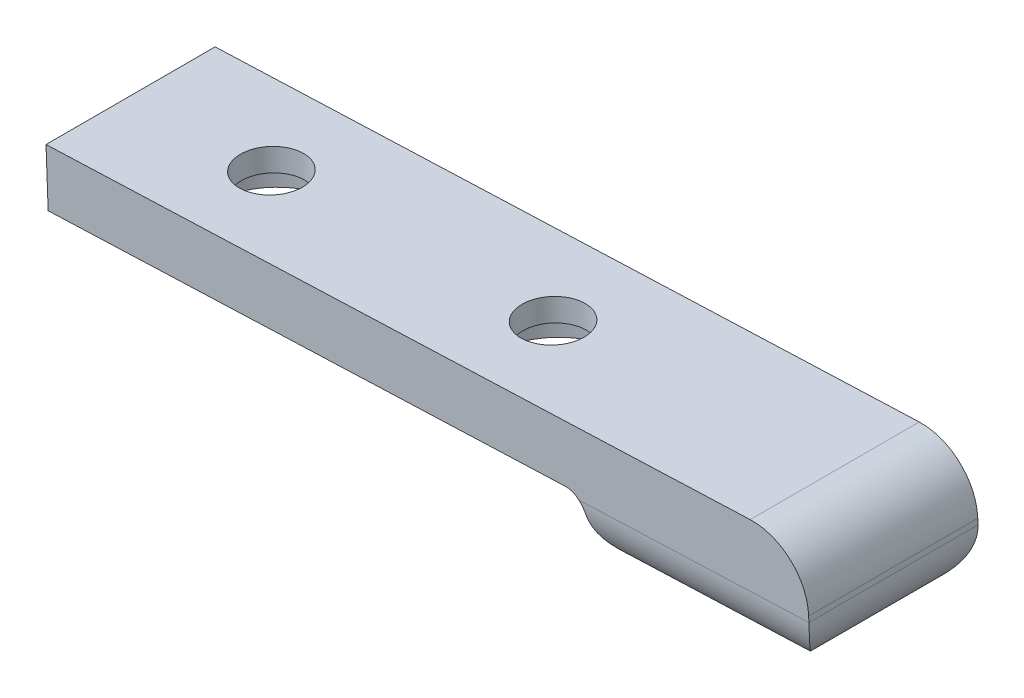
ISO-10303-21;
HEADER;
FILE_DESCRIPTION(('STEP AP214'),'2;1');
FILE_NAME('part.step','',(''),(''),'','','');
FILE_SCHEMA(('AUTOMOTIVE_DESIGN { 1 0 10303 214 1 1 1 1 }'));
ENDSEC;
DATA;
#1=APPLICATION_CONTEXT('core data for automotive mechanical design processes');
#2=APPLICATION_PROTOCOL_DEFINITION('international standard','automotive_design',2000,#1);
#3=PRODUCT_CONTEXT('',#1,'mechanical');
#4=PRODUCT('Part','Part','',(#3));
#5=PRODUCT_RELATED_PRODUCT_CATEGORY('part','',(#4));
#6=PRODUCT_DEFINITION_FORMATION('','',#4);
#7=PRODUCT_DEFINITION_CONTEXT('part definition',#1,'design');
#8=PRODUCT_DEFINITION('design','',#6,#7);
#9=PRODUCT_DEFINITION_SHAPE('','',#8);
#10=(LENGTH_UNIT() NAMED_UNIT(*) SI_UNIT(.MILLI.,.METRE.));
#11=(NAMED_UNIT(*) PLANE_ANGLE_UNIT() SI_UNIT($,.RADIAN.));
#12=(NAMED_UNIT(*) SI_UNIT($,.STERADIAN.) SOLID_ANGLE_UNIT());
#13=UNCERTAINTY_MEASURE_WITH_UNIT(LENGTH_MEASURE(1.E-05),#10,'distance_accuracy_value','');
#14=(GEOMETRIC_REPRESENTATION_CONTEXT(3) GLOBAL_UNCERTAINTY_ASSIGNED_CONTEXT((#13)) GLOBAL_UNIT_ASSIGNED_CONTEXT((#10,
#11,#12)) REPRESENTATION_CONTEXT('',''));
#15=CARTESIAN_POINT('',(0.,0.,0.));
#16=DIRECTION('',(0.,0.,1.));
#17=DIRECTION('',(1.,0.,0.));
#18=AXIS2_PLACEMENT_3D('',#15,#16,#17);
#19=CARTESIAN_POINT('',(-19.5902158138393,8.31178115992963,104.999971631863));
#20=DIRECTION('',(-0.0386212432650092,0.999253921467744,0.));
#21=DIRECTION('',(-0.999253921467744,-0.0386212432650092,0.));
#22=AXIS2_PLACEMENT_3D('',#19,#20,#21);
#23=CYLINDRICAL_SURFACE('',#22,1.10000000000001);
#24=CARTESIAN_POINT('',(-19.6674583003693,10.3102890028651,104.999971631863));
#25=DIRECTION('',(0.0386212432650092,-0.999253921467744,0.));
#26=DIRECTION('',(0.999253921467744,0.0386212432650092,0.));
#27=AXIS2_PLACEMENT_3D('',#24,#25,#26);
#28=CIRCLE('',#27,1.10000000000001);
#29=CARTESIAN_POINT('',(-18.5682789867548,10.3527723704566,104.999971631863));
#30=VERTEX_POINT('',#29);
#31=EDGE_CURVE('E269',#30,#30,#28,.T.);
#32=ORIENTED_EDGE('',*,*,#31,.F.);
#33=EDGE_LOOP('',(#32));
#34=FACE_BOUND('',#33,.T.);
#35=CARTESIAN_POINT('',(-19.6365613057573,9.51088586569093,104.999971631863));
#36=DIRECTION('',(0.0386212432650091,-0.999253921467744,0.));
#37=DIRECTION('',(0.999253921467744,0.0386212432650091,0.));
#38=AXIS2_PLACEMENT_3D('',#35,#36,#37);
#39=CIRCLE('',#38,1.10000000000001);
#40=CARTESIAN_POINT('',(-18.5373819921428,9.55336923328244,104.999971631863));
#41=VERTEX_POINT('',#40);
#42=EDGE_CURVE('E164',#41,#41,#39,.T.);
#43=ORIENTED_EDGE('',*,*,#42,.T.);
#44=EDGE_LOOP('',(#43));
#45=FACE_BOUND('',#44,.T.);
#46=ADVANCED_FACE('F33',(#34,#45),#23,.F.);
#47=CARTESIAN_POINT('',(-29.5827550285167,7.92556872727954,104.999971194749));
#48=DIRECTION('',(-0.0386212432650092,0.999253921467744,0.));
#49=DIRECTION('',(-0.999253921467744,-0.0386212432650092,0.));
#50=AXIS2_PLACEMENT_3D('',#47,#48,#49);
#51=CYLINDRICAL_SURFACE('',#50,1.10000000000001);
#52=CARTESIAN_POINT('',(-29.6599975150467,9.92407657021503,104.999971194749));
#53=DIRECTION('',(0.0386212432650092,-0.999253921467744,0.));
#54=DIRECTION('',(0.999253921467744,0.0386212432650092,0.));
#55=AXIS2_PLACEMENT_3D('',#52,#53,#54);
#56=CIRCLE('',#55,1.10000000000001);
#57=CARTESIAN_POINT('',(-28.5608182014322,9.96655993780654,104.999971194749));
#58=VERTEX_POINT('',#57);
#59=EDGE_CURVE('E173',#58,#58,#56,.T.);
#60=ORIENTED_EDGE('',*,*,#59,.F.);
#61=EDGE_LOOP('',(#60));
#62=FACE_BOUND('',#61,.T.);
#63=CARTESIAN_POINT('',(-29.6291005204347,9.12467343304083,104.999971194749));
#64=DIRECTION('',(0.0386212432650091,-0.999253921467744,0.));
#65=DIRECTION('',(0.999253921467744,0.0386212432650091,0.));
#66=AXIS2_PLACEMENT_3D('',#63,#64,#65);
#67=CIRCLE('',#66,1.10000000000001);
#68=CARTESIAN_POINT('',(-28.5299212068202,9.16715680063235,104.999971194749));
#69=VERTEX_POINT('',#68);
#70=EDGE_CURVE('E281',#69,#69,#67,.T.);
#71=ORIENTED_EDGE('',*,*,#70,.T.);
#72=EDGE_LOOP('',(#71));
#73=FACE_BOUND('',#72,.T.);
#74=ADVANCED_FACE('F227',(#62,#73),#51,.F.);
#75=CARTESIAN_POINT('',(-0.349992596844968,9.05541731223529,0.));
#76=DIRECTION('',(0.0386212432650091,-0.999253921467744,0.));
#77=DIRECTION('',(0.999253921467744,0.0386212432650091,0.));
#78=AXIS2_PLACEMENT_3D('',#75,#76,#77);
#79=PLANE('',#78);
#80=CARTESIAN_POINT('',(-29.5827550285167,7.92556872727954,104.999971194749));
#81=DIRECTION('',(0.0386212432650091,-0.999253921467744,0.));
#82=DIRECTION('',(0.999253921467744,0.0386212432650091,0.));
#83=AXIS2_PLACEMENT_3D('',#80,#81,#82);
#84=CIRCLE('',#83,2.25);
#85=CARTESIAN_POINT('',(-27.3344337052143,8.01246652462581,104.999971194749));
#86=VERTEX_POINT('',#85);
#87=EDGE_CURVE('E282',#86,#86,#84,.T.);
#88=ORIENTED_EDGE('',*,*,#87,.F.);
#89=EDGE_LOOP('',(#88));
#90=FACE_BOUND('',#89,.T.);
#91=CARTESIAN_POINT('',(-19.5902158138393,8.31178115992963,104.999971631863));
#92=DIRECTION('',(0.0386212432650091,-0.999253921467744,0.));
#93=DIRECTION('',(0.999253921467744,0.0386212432650091,0.));
#94=AXIS2_PLACEMENT_3D('',#91,#92,#93);
#95=CIRCLE('',#94,2.25);
#96=CARTESIAN_POINT('',(-17.3418944905369,8.39867895727591,104.999971631863));
#97=VERTEX_POINT('',#96);
#98=EDGE_CURVE('E275',#97,#97,#95,.T.);
#99=ORIENTED_EDGE('',*,*,#98,.F.);
#100=EDGE_LOOP('',(#99));
#101=FACE_BOUND('',#100,.T.);
#102=DIRECTION('',(0.999253921467744,0.0386212432650093,0.));
#103=VECTOR('',#102,1.);
#104=CARTESIAN_POINT('',(-34.5790246358554,7.73246251095449,101.999971282172));
#105=LINE('',#104,#103);
#106=CARTESIAN_POINT('',(-34.5790246358554,7.73246251095449,101.999971282172));
#107=VERTEX_POINT('',#106);
#108=CARTESIAN_POINT('',(-16.2460125472726,8.44103488124203,101.999971282172));
#109=VERTEX_POINT('',#108);
#110=EDGE_CURVE('E136',#107,#109,#105,.T.);
#111=ORIENTED_EDGE('',*,*,#110,.T.);
#112=DIRECTION('',(0.,0.,1.));
#113=VECTOR('',#112,1.);
#114=CARTESIAN_POINT('',(-16.2460125472726,8.44103488124203,107.999971282172));
#115=LINE('',#114,#113);
#116=CARTESIAN_POINT('',(-16.2460125472726,8.44103488124202,107.999971282172));
#117=VERTEX_POINT('',#116);
#118=EDGE_CURVE('E122',#109,#117,#115,.T.);
#119=ORIENTED_EDGE('',*,*,#118,.T.);
#120=DIRECTION('',(-0.999253921467744,-0.0386212432650091,0.));
#121=VECTOR('',#120,1.);
#122=CARTESIAN_POINT('',(-27.5842473166176,8.00281120874499,107.999971282172));
#123=LINE('',#122,#121);
#124=CARTESIAN_POINT('',(-34.5790246358554,7.73246251095449,107.999971282172));
#125=VERTEX_POINT('',#124);
#126=EDGE_CURVE('E115',#117,#125,#123,.T.);
#127=ORIENTED_EDGE('',*,*,#126,.T.);
#128=DIRECTION('',(0.,0.,-1.));
#129=VECTOR('',#128,1.);
#130=CARTESIAN_POINT('',(-34.5790246358554,7.73246251095449,107.999971282172));
#131=LINE('',#130,#129);
#132=EDGE_CURVE('E119',#125,#107,#131,.T.);
#133=ORIENTED_EDGE('',*,*,#132,.T.);
#134=EDGE_LOOP('',(#111,#119,#127,#133));
#135=FACE_BOUND('',#134,.T.);
#136=ADVANCED_FACE('F118',(#90,#101,#135),#79,.T.);
#137=CARTESIAN_POINT('',(-0.427235083374987,11.0539251551708,0.));
#138=DIRECTION('',(0.0386212432650091,-0.999253921467744,0.));
#139=DIRECTION('',(0.999253921467744,0.0386212432650091,0.));
#140=AXIS2_PLACEMENT_3D('',#137,#138,#139);
#141=PLANE('',#140);
#142=DIRECTION('',(-0.999253921467743,-0.0386212432650091,-4.3711388675316E-08));
#143=VECTOR('',#142,1.);
#144=CARTESIAN_POINT('',(-27.6614898031476,10.0013190516805,107.999971282172));
#145=LINE('',#144,#143);
#146=CARTESIAN_POINT('',(-9.67491908569187,10.6965014355152,107.999972068977));
#147=VERTEX_POINT('',#146);
#148=CARTESIAN_POINT('',(-34.6562671223855,9.73097035388998,107.999971282172));
#149=VERTEX_POINT('',#148);
#150=EDGE_CURVE('E126',#147,#149,#145,.T.);
#151=ORIENTED_EDGE('',*,*,#150,.F.);
#152=DIRECTION('',(0.,0.,1.));
#153=VECTOR('',#152,1.);
#154=CARTESIAN_POINT('',(-9.67491908569187,10.6965014355152,0.));
#155=LINE('',#154,#153);
#156=CARTESIAN_POINT('',(-9.67491908569187,10.6965014355152,101.999971666832));
#157=VERTEX_POINT('',#156);
#158=EDGE_CURVE('E178',#147,#157,#155,.F.);
#159=ORIENTED_EDGE('',*,*,#158,.T.);
#160=DIRECTION('',(0.999253921467744,0.0386212432650093,0.));
#161=VECTOR('',#160,1.);
#162=CARTESIAN_POINT('',(-18.8680550321588,10.3411860025417,101.999971666832));
#163=LINE('',#162,#161);
#164=CARTESIAN_POINT('',(-34.6562671223855,9.73097035388998,101.999971282172));
#165=VERTEX_POINT('',#164);
#166=EDGE_CURVE('E257',#165,#157,#163,.T.);
#167=ORIENTED_EDGE('',*,*,#166,.F.);
#168=DIRECTION('',(0.,0.,-1.));
#169=VECTOR('',#168,1.);
#170=CARTESIAN_POINT('',(-34.6562671223855,9.73097035388998,107.999971282172));
#171=LINE('',#170,#169);
#172=EDGE_CURVE('E259',#149,#165,#171,.T.);
#173=ORIENTED_EDGE('',*,*,#172,.F.);
#174=EDGE_LOOP('',(#151,#159,#167,#173));
#175=FACE_BOUND('',#174,.T.);
#176=ORIENTED_EDGE('',*,*,#31,.T.);
#177=EDGE_LOOP('',(#176));
#178=FACE_BOUND('',#177,.T.);
#179=ORIENTED_EDGE('',*,*,#59,.T.);
#180=EDGE_LOOP('',(#179));
#181=FACE_BOUND('',#180,.T.);
#182=ADVANCED_FACE('F241',(#175,#178,#181),#141,.F.);
#183=CARTESIAN_POINT('',(-34.5790246358554,7.73246251095449,107.999971282172));
#184=DIRECTION('',(0.999253921467744,0.0386212432650092,0.));
#185=DIRECTION('',(-0.0386212432650092,0.999253921467744,0.));
#186=AXIS2_PLACEMENT_3D('',#183,#184,#185);
#187=PLANE('',#186);
#188=ORIENTED_EDGE('',*,*,#172,.T.);
#189=DIRECTION('',(-0.0386212432650092,0.999253921467744,0.));
#190=VECTOR('',#189,1.);
#191=CARTESIAN_POINT('',(-34.5790246358554,7.73246251095449,101.999971282172));
#192=LINE('',#191,#190);
#193=EDGE_CURVE('E134',#107,#165,#192,.T.);
#194=ORIENTED_EDGE('',*,*,#193,.F.);
#195=ORIENTED_EDGE('',*,*,#132,.F.);
#196=DIRECTION('',(-0.0386212432650092,0.999253921467744,0.));
#197=VECTOR('',#196,1.);
#198=CARTESIAN_POINT('',(-34.5790246358554,7.73246251095449,107.999971282172));
#199=LINE('',#198,#197);
#200=EDGE_CURVE('E132',#125,#149,#199,.T.);
#201=ORIENTED_EDGE('',*,*,#200,.T.);
#202=EDGE_LOOP('',(#188,#194,#195,#201));
#203=FACE_BOUND('',#202,.T.);
#204=ADVANCED_FACE('F131',(#203),#187,.F.);
#205=CARTESIAN_POINT('',(-18.7908125456288,8.3426781596062,101.999971666832));
#206=DIRECTION('',(0.,0.,1.));
#207=DIRECTION('',(0.,-1.,0.));
#208=AXIS2_PLACEMENT_3D('',#205,#206,#207);
#209=PLANE('',#208);
#210=ORIENTED_EDGE('',*,*,#166,.T.);
#211=CARTESIAN_POINT('',(-9.59767659916185,8.69799359257972,101.999971666832));
#212=DIRECTION('',(0.,0.,1.));
#213=DIRECTION('',(0.,-1.,0.));
#214=AXIS2_PLACEMENT_3D('',#211,#212,#213);
#215=CIRCLE('',#214,2.);
#216=CARTESIAN_POINT('',(-7.59916875622636,8.77523607910974,101.999971666832));
#217=VERTEX_POINT('',#216);
#218=EDGE_CURVE('E180',#157,#217,#215,.F.);
#219=ORIENTED_EDGE('',*,*,#218,.T.);
#220=DIRECTION('',(-0.0386212432650092,0.999253921467744,0.));
#221=VECTOR('',#220,1.);
#222=CARTESIAN_POINT('',(-7.59916875622636,8.77523607910974,101.999971666832));
#223=LINE('',#222,#221);
#224=CARTESIAN_POINT('',(-7.59144450757336,8.57538529481616,101.999971666832));
#225=VERTEX_POINT('',#224);
#226=EDGE_CURVE('E146',#225,#217,#223,.T.);
#227=ORIENTED_EDGE('',*,*,#226,.F.);
#228=DIRECTION('',(0.999253921467744,0.0386212432650093,0.));
#229=VECTOR('',#228,1.);
#230=CARTESIAN_POINT('',(-18.7830882969758,8.14282737531262,101.999971666832));
#231=LINE('',#230,#229);
#232=CARTESIAN_POINT('',(-15.7487558524052,8.26010456479469,101.999971666832));
#233=VERTEX_POINT('',#232);
#234=EDGE_CURVE('E61',#225,#233,#231,.F.);
#235=ORIENTED_EDGE('',*,*,#234,.T.);
#236=CARTESIAN_POINT('',(-16.2189776769871,7.74155713621458,101.999971666832));
#237=DIRECTION('',(0.,0.,1.));
#238=DIRECTION('',(0.,-1.,0.));
#239=AXIS2_PLACEMENT_3D('',#236,#237,#238);
#240=CIRCLE('',#239,0.7);
#241=EDGE_CURVE('E196',#233,#109,#240,.T.);
#242=ORIENTED_EDGE('',*,*,#241,.T.);
#243=ORIENTED_EDGE('',*,*,#110,.F.);
#244=ORIENTED_EDGE('',*,*,#193,.T.);
#245=EDGE_LOOP('',(#210,#219,#227,#235,#242,#243,#244));
#246=FACE_BOUND('',#245,.T.);
#247=ADVANCED_FACE('F250',(#246),#209,.F.);
#248=CARTESIAN_POINT('',(-7.59916875622636,8.77523607910974,101.999971666832));
#249=DIRECTION('',(-0.999253921467744,-0.0386212432650092,0.));
#250=DIRECTION('',(0.0386212432650092,-0.999253921467744,0.));
#251=AXIS2_PLACEMENT_3D('',#248,#249,#250);
#252=PLANE('',#251);
#253=ORIENTED_EDGE('',*,*,#226,.T.);
#254=DIRECTION('',(0.,0.,1.));
#255=VECTOR('',#254,1.);
#256=CARTESIAN_POINT('',(-7.59916875622636,8.77523607910974,101.999971666832));
#257=LINE('',#256,#255);
#258=CARTESIAN_POINT('',(-7.59916875622636,8.77523607910974,107.999971666832));
#259=VERTEX_POINT('',#258);
#260=EDGE_CURVE('E160',#217,#259,#257,.T.);
#261=ORIENTED_EDGE('',*,*,#260,.T.);
#262=DIRECTION('',(-0.0386212432650092,0.999253921467744,0.));
#263=VECTOR('',#262,1.);
#264=CARTESIAN_POINT('',(-7.59916875622636,8.77523607910974,107.999971666832));
#265=LINE('',#264,#263);
#266=CARTESIAN_POINT('',(-7.59144450757336,8.57538529481616,107.999971666832));
#267=VERTEX_POINT('',#266);
#268=EDGE_CURVE('E264',#267,#259,#265,.T.);
#269=ORIENTED_EDGE('',*,*,#268,.F.);
#270=DIRECTION('',(0.,0.,1.));
#271=VECTOR('',#270,1.);
#272=CARTESIAN_POINT('',(-7.59144450757336,8.57538529481616,101.999971666832));
#273=LINE('',#272,#271);
#274=EDGE_CURVE('E158',#267,#225,#273,.F.);
#275=ORIENTED_EDGE('',*,*,#274,.T.);
#276=EDGE_LOOP('',(#253,#261,#269,#275));
#277=FACE_BOUND('',#276,.T.);
#278=ADVANCED_FACE('F248',(#277),#252,.F.);
#279=CARTESIAN_POINT('',(-27.5842473166176,8.00281120874499,107.999971282172));
#280=DIRECTION('',(4.36787765393407E-08,1.68818836356756E-09,-0.999999999999999));
#281=DIRECTION('',(-0.999999999999999,0.,-4.36787765393407E-08));
#282=AXIS2_PLACEMENT_3D('',#279,#280,#281);
#283=PLANE('',#282);
#284=ORIENTED_EDGE('',*,*,#268,.T.);
#285=CARTESIAN_POINT('',(-9.59767659916185,8.69799359257972,107.999972068977));
#286=DIRECTION('',(4.36787765393407E-08,1.68818836356756E-09,-0.999999999999999));
#287=DIRECTION('',(-0.999999999999999,0.,-4.36787765393407E-08));
#288=AXIS2_PLACEMENT_3D('',#285,#286,#287);
#289=CIRCLE('',#288,2.);
#290=EDGE_CURVE('E176',#259,#147,#289,.F.);
#291=ORIENTED_EDGE('',*,*,#290,.T.);
#292=ORIENTED_EDGE('',*,*,#150,.T.);
#293=ORIENTED_EDGE('',*,*,#200,.F.);
#294=ORIENTED_EDGE('',*,*,#126,.F.);
#295=CARTESIAN_POINT('',(-16.2189776769871,7.74155713621458,107.999971778152));
#296=DIRECTION('',(4.36787765393407E-08,1.68818836356756E-09,-0.999999999999999));
#297=DIRECTION('',(-0.999999999999999,0.,-4.36787765393407E-08));
#298=AXIS2_PLACEMENT_3D('',#295,#296,#297);
#299=CIRCLE('',#298,0.7);
#300=CARTESIAN_POINT('',(-15.7487558524052,8.26010456479469,107.999971799566));
#301=VERTEX_POINT('',#300);
#302=EDGE_CURVE('E47',#117,#301,#299,.T.);
#303=ORIENTED_EDGE('',*,*,#302,.T.);
#304=DIRECTION('',(-0.999253921467743,-0.0386212432650092,-4.3711388675316E-08));
#305=VECTOR('',#304,1.);
#306=CARTESIAN_POINT('',(-27.5765230679646,7.80296042445141,107.999971282172));
#307=LINE('',#306,#305);
#308=EDGE_CURVE('E53',#301,#267,#307,.F.);
#309=ORIENTED_EDGE('',*,*,#308,.T.);
#310=EDGE_LOOP('',(#284,#291,#292,#293,#294,#303,#309));
#311=FACE_BOUND('',#310,.T.);
#312=ADVANCED_FACE('F139',(#311),#283,.F.);
#313=CARTESIAN_POINT('',(-0.265025861661949,6.85705868500625,0.));
#314=DIRECTION('',(-0.0386212432650093,0.999253921467744,0.));
#315=DIRECTION('',(-0.999253921467744,-0.0386212432650093,0.));
#316=AXIS2_PLACEMENT_3D('',#313,#314,#315);
#317=PLANE('',#316);
#318=DIRECTION('',(0.,0.,-1.));
#319=VECTOR('',#318,1.);
#320=CARTESIAN_POINT('',(-13.5097255498498,6.34514999229065,0.));
#321=LINE('',#320,#319);
#322=CARTESIAN_POINT('',(-13.5097255498498,6.34514999229062,105.999971894131));
#323=VERTEX_POINT('',#322);
#324=CARTESIAN_POINT('',(-13.5097255498498,6.34514999229062,103.999971666832));
#325=VERTEX_POINT('',#324);
#326=EDGE_CURVE('E151',#323,#325,#321,.T.);
#327=ORIENTED_EDGE('',*,*,#326,.T.);
#328=DIRECTION('',(0.999253921467744,0.0386212432650093,0.));
#329=VECTOR('',#328,1.);
#330=CARTESIAN_POINT('',(-0.265025861661948,6.85705868500622,103.999971666832));
#331=LINE('',#330,#329);
#332=CARTESIAN_POINT('',(-9.51270986397883,6.49963496535066,103.999971666832));
#333=VERTEX_POINT('',#332);
#334=EDGE_CURVE('E153',#325,#333,#331,.T.);
#335=ORIENTED_EDGE('',*,*,#334,.T.);
#336=DIRECTION('',(0.,0.,1.));
#337=VECTOR('',#336,1.);
#338=CARTESIAN_POINT('',(-9.51270986397883,6.49963496535068,0.));
#339=LINE('',#338,#337);
#340=CARTESIAN_POINT('',(-9.51270986397883,6.49963496535065,105.999972068977));
#341=VERTEX_POINT('',#340);
#342=EDGE_CURVE('E142',#333,#341,#339,.T.);
#343=ORIENTED_EDGE('',*,*,#342,.T.);
#344=DIRECTION('',(-0.999253921467743,-0.0386212432650092,-4.3711388675316E-08));
#345=VECTOR('',#344,1.);
#346=CARTESIAN_POINT('',(-0.26503049161106,6.85705850605832,105.999972473507));
#347=LINE('',#346,#345);
#348=EDGE_CURVE('E144',#341,#323,#347,.T.);
#349=ORIENTED_EDGE('',*,*,#348,.T.);
#350=EDGE_LOOP('',(#327,#335,#343,#349));
#351=FACE_BOUND('',#350,.T.);
#352=ADVANCED_FACE('F215',(#351),#317,.F.);
#353=CARTESIAN_POINT('',(-0.342272978141078,8.85556634899381,105.999972473507));
#354=DIRECTION('',(-0.999253921467743,-0.0386212432650092,-4.3711388675316E-08));
#355=DIRECTION('',(0.0386212432650093,-0.999253921467744,0.));
#356=AXIS2_PLACEMENT_3D('',#353,#354,#355);
#357=CYLINDRICAL_SURFACE('',#356,2.);
#358=CARTESIAN_POINT('',(-9.58995235050885,8.49814280828614,105.999972068977));
#359=DIRECTION('',(-0.706579239439871,-0.0273093436074082,0.707106765732238));
#360=DIRECTION('',(0.706579208554312,0.0273093424136785,0.707106796640857));
#361=AXIS2_PLACEMENT_3D('',#358,#359,#360);
#362=ELLIPSE('',#361,2.82842718656343,2.);
#363=EDGE_CURVE('E167',#267,#341,#362,.F.);
#364=ORIENTED_EDGE('',*,*,#363,.F.);
#365=ORIENTED_EDGE('',*,*,#308,.F.);
#366=CARTESIAN_POINT('',(-15.7487558524052,8.26010456479469,107.999971799566));
#367=CARTESIAN_POINT('',(-15.7201717023874,8.23424018048545,107.999988611582));
#368=CARTESIAN_POINT('',(-15.6937715487446,8.20594749426462,107.999428086631));
#369=CARTESIAN_POINT('',(-15.6466114030474,8.14626781693998,107.996732165359));
#370=CARTESIAN_POINT('',(-15.6257218853348,8.11498118409308,107.994638368542));
#371=CARTESIAN_POINT('',(-15.5915035090487,8.05358074882353,107.988874135175));
#372=CARTESIAN_POINT('',(-15.5775651500683,8.02378439231893,107.985425547267));
#373=CARTESIAN_POINT('',(-15.5537544699369,7.96202662037883,107.976782770287));
#374=CARTESIAN_POINT('',(-15.5439858006624,7.93003071613615,107.971549329118));
#375=CARTESIAN_POINT('',(-15.5366048072,7.89765731743979,107.965379091394));
#376=B_SPLINE_CURVE_WITH_KNOTS('',3,(#366,#367,#368,#369,#370,#371,#372,#373,#374,#375),
.UNSPECIFIED.,.F.,.F.,(4,2,2,2,4),(0.,0.115530661730941,0.228037797228606,0.326908895057913,
0.428111891408855),.UNSPECIFIED.);
#377=CARTESIAN_POINT('',(-15.5366048072,7.89765731743979,107.965379091394));
#378=VERTEX_POINT('',#377);
#379=EDGE_CURVE('E11',#301,#378,#376,.T.);
#380=ORIENTED_EDGE('',*,*,#379,.T.);
#381=CARTESIAN_POINT('',(-13.5869680363798,8.34365783522611,105.999971894131));
#382=DIRECTION('',(-0.706579208554312,-0.0273093424136785,-0.707106796640857));
#383=DIRECTION('',(-0.706579239439871,-0.0273093436074082,0.707106765732237));
#384=AXIS2_PLACEMENT_3D('',#381,#382,#383);
#385=ELLIPSE('',#384,2.82842706292895,2.);
#386=EDGE_CURVE('E170',#323,#378,#385,.T.);
#387=ORIENTED_EDGE('',*,*,#386,.F.);
#388=ORIENTED_EDGE('',*,*,#348,.F.);
#389=EDGE_LOOP('',(#364,#365,#380,#387,#388));
#390=FACE_BOUND('',#389,.T.);
#391=ADVANCED_FACE('F211',(#390),#357,.T.);
#392=CARTESIAN_POINT('',(-13.5869680363798,8.34365783522614,0.));
#393=DIRECTION('',(0.,0.,-1.));
#394=DIRECTION('',(-1.,0.,0.));
#395=AXIS2_PLACEMENT_3D('',#392,#393,#394);
#396=CYLINDRICAL_SURFACE('',#395,2.);
#397=ORIENTED_EDGE('',*,*,#386,.T.);
#398=DIRECTION('',(0.,0.,-1.));
#399=VECTOR('',#398,1.);
#400=CARTESIAN_POINT('',(-15.5366048072,7.89765731743982,0.));
#401=LINE('',#400,#399);
#402=CARTESIAN_POINT('',(-15.5366048072,7.89765731743979,102.034564383658));
#403=VERTEX_POINT('',#402);
#404=EDGE_CURVE('E182',#378,#403,#401,.T.);
#405=ORIENTED_EDGE('',*,*,#404,.T.);
#406=CARTESIAN_POINT('',(-13.5869680363798,8.34365783522611,103.999971666832));
#407=DIRECTION('',(0.706579223997092,0.0273093430105435,-0.707106781186547));
#408=DIRECTION('',(-0.706579223997092,-0.0273093430105431,-0.707106781186548));
#409=AXIS2_PLACEMENT_3D('',#406,#407,#408);
#410=ELLIPSE('',#409,2.82842712474619,2.);
#411=EDGE_CURVE('E163',#325,#403,#410,.T.);
#412=ORIENTED_EDGE('',*,*,#411,.F.);
#413=ORIENTED_EDGE('',*,*,#326,.F.);
#414=EDGE_LOOP('',(#397,#405,#412,#413));
#415=FACE_BOUND('',#414,.T.);
#416=ADVANCED_FACE('F208',(#415),#396,.T.);
#417=CARTESIAN_POINT('',(-9.58995235050885,8.49814280828617,0.));
#418=DIRECTION('',(0.,0.,1.));
#419=DIRECTION('',(0.,-1.,0.));
#420=AXIS2_PLACEMENT_3D('',#417,#418,#419);
#421=CYLINDRICAL_SURFACE('',#420,2.);
#422=ORIENTED_EDGE('',*,*,#363,.T.);
#423=ORIENTED_EDGE('',*,*,#342,.F.);
#424=CARTESIAN_POINT('',(-9.58995235050885,8.49814280828614,103.999971666832));
#425=DIRECTION('',(0.706579223997092,0.0273093430105431,0.707106781186547));
#426=DIRECTION('',(-0.706579223997092,-0.0273093430105435,0.707106781186547));
#427=AXIS2_PLACEMENT_3D('',#424,#425,#426);
#428=ELLIPSE('',#427,2.82842712474619,2.);
#429=EDGE_CURVE('E161',#225,#333,#428,.F.);
#430=ORIENTED_EDGE('',*,*,#429,.F.);
#431=ORIENTED_EDGE('',*,*,#274,.F.);
#432=EDGE_LOOP('',(#422,#423,#430,#431));
#433=FACE_BOUND('',#432,.T.);
#434=ADVANCED_FACE('F203',(#433),#421,.T.);
#435=CARTESIAN_POINT('',(-0.342268348191967,8.85556652794171,103.999971666832));
#436=DIRECTION('',(0.999253921467744,0.0386212432650093,0.));
#437=DIRECTION('',(-0.0386212432650093,0.999253921467744,0.));
#438=AXIS2_PLACEMENT_3D('',#435,#436,#437);
#439=CYLINDRICAL_SURFACE('',#438,2.);
#440=ORIENTED_EDGE('',*,*,#411,.T.);
#441=CARTESIAN_POINT('',(-15.5366048072,7.89765731743979,102.034564383658));
#442=CARTESIAN_POINT('',(-15.5408160864869,7.91606918637468,102.03106521525));
#443=CARTESIAN_POINT('',(-15.5457844036493,7.93435426141631,102.027859933952));
#444=CARTESIAN_POINT('',(-15.5572182829871,7.97054357635287,102.022021590928));
#445=CARTESIAN_POINT('',(-15.5636838474555,7.98844781566449,102.019388530077));
#446=CARTESIAN_POINT('',(-15.5849130915584,8.04044781159775,102.012451169467));
#447=CARTESIAN_POINT('',(-15.6017400720343,8.07383535142924,102.008922733079));
#448=CARTESIAN_POINT('',(-15.6383462645146,8.13393584072293,102.004012372359));
#449=CARTESIAN_POINT('',(-15.6575703145239,8.16097579949148,102.002431616205));
#450=CARTESIAN_POINT('',(-15.7001603462694,8.21270880719152,102.000393587984));
#451=CARTESIAN_POINT('',(-15.7236135804755,8.23733117354162,101.999963788347));
#452=CARTESIAN_POINT('',(-15.7487558524053,8.26010456479461,101.999971666832));
#453=B_SPLINE_CURVE_WITH_KNOTS('',3,(#441,#442,#443,#444,#445,#446,#447,#448,#449,#450,#451,
#452),.UNSPECIFIED.,.F.,.F.,(4,2,2,2,2,4),(0.,0.0575902662841166,0.115180620770347,
0.227259923236449,0.326563437291459,0.428216961115458),.UNSPECIFIED.);
#454=EDGE_CURVE('E189',#403,#233,#453,.T.);
#455=ORIENTED_EDGE('',*,*,#454,.T.);
#456=ORIENTED_EDGE('',*,*,#234,.F.);
#457=ORIENTED_EDGE('',*,*,#429,.T.);
#458=ORIENTED_EDGE('',*,*,#334,.F.);
#459=EDGE_LOOP('',(#440,#455,#456,#457,#458));
#460=FACE_BOUND('',#459,.T.);
#461=ADVANCED_FACE('F197',(#460),#439,.T.);
#462=CARTESIAN_POINT('',(-9.59767659916185,8.69799359257972,101.999971666832));
#463=DIRECTION('',(0.,0.,1.));
#464=DIRECTION('',(1.,0.,0.));
#465=AXIS2_PLACEMENT_3D('',#462,#463,#464);
#466=CYLINDRICAL_SURFACE('',#465,2.);
#467=ORIENTED_EDGE('',*,*,#218,.F.);
#468=ORIENTED_EDGE('',*,*,#158,.F.);
#469=ORIENTED_EDGE('',*,*,#290,.F.);
#470=ORIENTED_EDGE('',*,*,#260,.F.);
#471=EDGE_LOOP('',(#467,#468,#469,#470));
#472=FACE_BOUND('',#471,.T.);
#473=ADVANCED_FACE('F202',(#472),#466,.T.);
#474=CARTESIAN_POINT('',(-29.6291005204347,9.12467343304083,104.999971194749));
#475=DIRECTION('',(0.0386212432650091,-0.999253921467744,0.));
#476=DIRECTION('',(0.999253921467744,0.0386212432650091,0.));
#477=AXIS2_PLACEMENT_3D('',#474,#475,#476);
#478=CYLINDRICAL_SURFACE('',#477,2.25);
#479=CARTESIAN_POINT('',(-29.6291005204347,9.12467343304083,104.999971194749));
#480=DIRECTION('',(0.0386212432650091,-0.999253921467744,0.));
#481=DIRECTION('',(0.999253921467744,0.0386212432650091,0.));
#482=AXIS2_PLACEMENT_3D('',#479,#480,#481);
#483=CIRCLE('',#482,2.25);
#484=CARTESIAN_POINT('',(-27.3807791971323,9.21157123038711,104.999971194749));
#485=VERTEX_POINT('',#484);
#486=EDGE_CURVE('E185',#485,#485,#483,.T.);
#487=ORIENTED_EDGE('',*,*,#486,.F.);
#488=EDGE_LOOP('',(#487));
#489=FACE_BOUND('',#488,.T.);
#490=ORIENTED_EDGE('',*,*,#87,.T.);
#491=EDGE_LOOP('',(#490));
#492=FACE_BOUND('',#491,.T.);
#493=ADVANCED_FACE('F217',(#489,#492),#478,.F.);
#494=CARTESIAN_POINT('',(-29.6291005204347,9.12467343304083,104.999971194749));
#495=DIRECTION('',(0.0386212432650091,-0.999253921467744,0.));
#496=DIRECTION('',(0.999253921467744,0.0386212432650091,0.));
#497=AXIS2_PLACEMENT_3D('',#494,#495,#496);
#498=PLANE('',#497);
#499=ORIENTED_EDGE('',*,*,#70,.F.);
#500=EDGE_LOOP('',(#499));
#501=FACE_BOUND('',#500,.T.);
#502=ORIENTED_EDGE('',*,*,#486,.T.);
#503=EDGE_LOOP('',(#502));
#504=FACE_BOUND('',#503,.T.);
#505=ADVANCED_FACE('F222',(#501,#504),#498,.T.);
#506=CARTESIAN_POINT('',(-19.6365613057573,9.51088586569093,104.999971631863));
#507=DIRECTION('',(0.0386212432650091,-0.999253921467744,0.));
#508=DIRECTION('',(0.999253921467744,0.0386212432650091,0.));
#509=AXIS2_PLACEMENT_3D('',#506,#507,#508);
#510=CYLINDRICAL_SURFACE('',#509,2.25);
#511=CARTESIAN_POINT('',(-19.6365613057573,9.51088586569093,104.999971631863));
#512=DIRECTION('',(0.0386212432650091,-0.999253921467744,0.));
#513=DIRECTION('',(0.999253921467744,0.0386212432650091,0.));
#514=AXIS2_PLACEMENT_3D('',#511,#512,#513);
#515=CIRCLE('',#514,2.25);
#516=CARTESIAN_POINT('',(-17.3882399824549,9.5977836630372,104.999971631863));
#517=VERTEX_POINT('',#516);
#518=EDGE_CURVE('E278',#517,#517,#515,.T.);
#519=ORIENTED_EDGE('',*,*,#518,.F.);
#520=EDGE_LOOP('',(#519));
#521=FACE_BOUND('',#520,.T.);
#522=ORIENTED_EDGE('',*,*,#98,.T.);
#523=EDGE_LOOP('',(#522));
#524=FACE_BOUND('',#523,.T.);
#525=ADVANCED_FACE('F293',(#521,#524),#510,.F.);
#526=CARTESIAN_POINT('',(-19.6365613057573,9.51088586569093,104.999971631863));
#527=DIRECTION('',(0.0386212432650091,-0.999253921467744,0.));
#528=DIRECTION('',(0.999253921467744,0.0386212432650091,0.));
#529=AXIS2_PLACEMENT_3D('',#526,#527,#528);
#530=PLANE('',#529);
#531=ORIENTED_EDGE('',*,*,#42,.F.);
#532=EDGE_LOOP('',(#531));
#533=FACE_BOUND('',#532,.T.);
#534=ORIENTED_EDGE('',*,*,#518,.T.);
#535=EDGE_LOOP('',(#534));
#536=FACE_BOUND('',#535,.T.);
#537=ADVANCED_FACE('F302',(#533,#536),#530,.T.);
#538=CARTESIAN_POINT('',(-16.2189776769871,7.74155713621461,0.));
#539=DIRECTION('',(0.,0.,-1.));
#540=DIRECTION('',(-1.,0.,0.));
#541=AXIS2_PLACEMENT_3D('',#538,#539,#540);
#542=CYLINDRICAL_SURFACE('',#541,0.7);
#543=ORIENTED_EDGE('',*,*,#302,.F.);
#544=ORIENTED_EDGE('',*,*,#118,.F.);
#545=ORIENTED_EDGE('',*,*,#241,.F.);
#546=ORIENTED_EDGE('',*,*,#454,.F.);
#547=ORIENTED_EDGE('',*,*,#404,.F.);
#548=ORIENTED_EDGE('',*,*,#379,.F.);
#549=EDGE_LOOP('',(#543,#544,#545,#546,#547,#548));
#550=FACE_BOUND('',#549,.T.);
#551=ADVANCED_FACE('F35',(#550),#542,.F.);
#552=CLOSED_SHELL('',(#46,#74,#136,#182,#204,#247,#278,#312,#352,#391,#416,#434,#461,#473,#493,
#505,#525,#537,#551));
#553=MANIFOLD_SOLID_BREP('B2',#552);
#554=ADVANCED_BREP_SHAPE_REPRESENTATION('',(#18,#553),#14);
#555=SHAPE_DEFINITION_REPRESENTATION(#9,#554);
ENDSEC;
END-ISO-10303-21;
